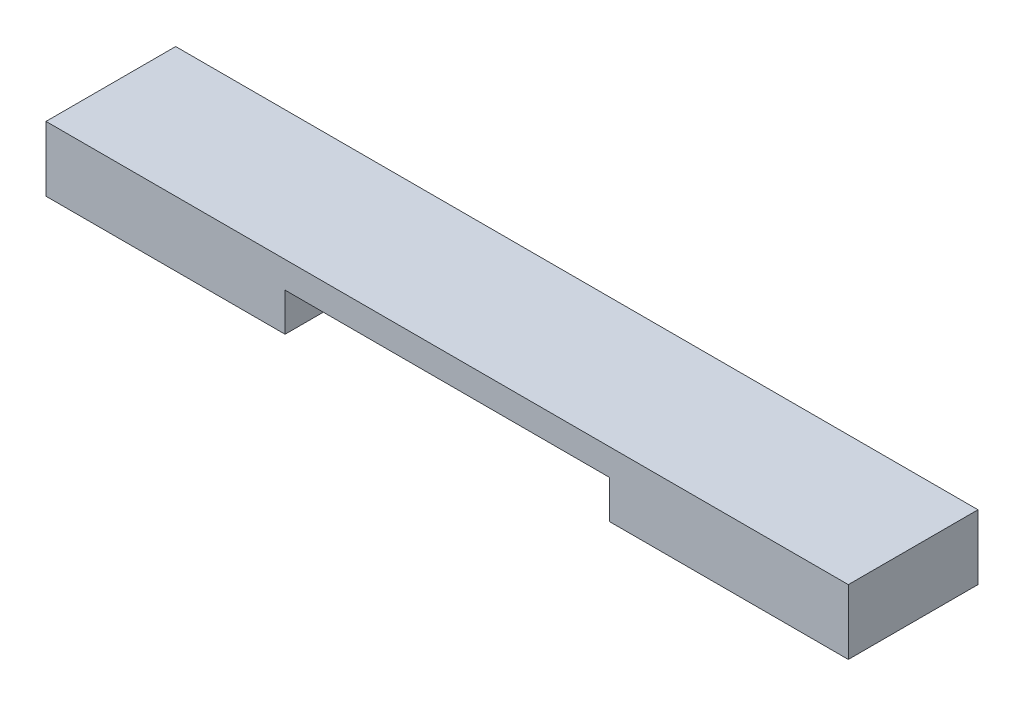
ISO-10303-21;
HEADER;
FILE_DESCRIPTION(('STEP AP214'),'2;1');
FILE_NAME('part.step','',(''),(''),'','','');
FILE_SCHEMA(('AUTOMOTIVE_DESIGN { 1 0 10303 214 1 1 1 1 }'));
ENDSEC;
DATA;
#1=APPLICATION_CONTEXT('core data for automotive mechanical design processes');
#2=APPLICATION_PROTOCOL_DEFINITION('international standard','automotive_design',2000,#1);
#3=PRODUCT_CONTEXT('',#1,'mechanical');
#4=PRODUCT('Part','Part','',(#3));
#5=PRODUCT_RELATED_PRODUCT_CATEGORY('part','',(#4));
#6=PRODUCT_DEFINITION_FORMATION('','',#4);
#7=PRODUCT_DEFINITION_CONTEXT('part definition',#1,'design');
#8=PRODUCT_DEFINITION('design','',#6,#7);
#9=PRODUCT_DEFINITION_SHAPE('','',#8);
#10=(LENGTH_UNIT() NAMED_UNIT(*) SI_UNIT(.MILLI.,.METRE.));
#11=(NAMED_UNIT(*) PLANE_ANGLE_UNIT() SI_UNIT($,.RADIAN.));
#12=(NAMED_UNIT(*) SI_UNIT($,.STERADIAN.) SOLID_ANGLE_UNIT());
#13=UNCERTAINTY_MEASURE_WITH_UNIT(LENGTH_MEASURE(1.E-05),#10,'distance_accuracy_value','');
#14=(GEOMETRIC_REPRESENTATION_CONTEXT(3) GLOBAL_UNCERTAINTY_ASSIGNED_CONTEXT((#13)) GLOBAL_UNIT_ASSIGNED_CONTEXT((#10,
#11,#12)) REPRESENTATION_CONTEXT('',''));
#15=CARTESIAN_POINT('',(0.,0.,0.));
#16=DIRECTION('',(0.,0.,1.));
#17=DIRECTION('',(1.,0.,0.));
#18=AXIS2_PLACEMENT_3D('',#15,#16,#17);
#19=CARTESIAN_POINT('',(24.75,-1.99999999999999,8.));
#20=DIRECTION('',(-1.,0.,0.));
#21=DIRECTION('',(0.,0.,1.));
#22=AXIS2_PLACEMENT_3D('',#19,#20,#21);
#23=PLANE('',#22);
#24=DIRECTION('',(0.,1.,0.));
#25=VECTOR('',#24,1.);
#26=CARTESIAN_POINT('',(24.75,-1.99999999999999,0.));
#27=LINE('',#26,#25);
#28=CARTESIAN_POINT('',(24.75,-1.99999999999999,0.));
#29=VERTEX_POINT('',#28);
#30=CARTESIAN_POINT('',(24.75,2.,0.));
#31=VERTEX_POINT('',#30);
#32=EDGE_CURVE('E129',#29,#31,#27,.T.);
#33=ORIENTED_EDGE('',*,*,#32,.T.);
#34=DIRECTION('',(0.,0.,-1.));
#35=VECTOR('',#34,1.);
#36=CARTESIAN_POINT('',(24.75,2.,8.));
#37=LINE('',#36,#35);
#38=CARTESIAN_POINT('',(24.75,2.,8.));
#39=VERTEX_POINT('',#38);
#40=EDGE_CURVE('E11',#39,#31,#37,.T.);
#41=ORIENTED_EDGE('',*,*,#40,.F.);
#42=DIRECTION('',(0.,1.,0.));
#43=VECTOR('',#42,1.);
#44=CARTESIAN_POINT('',(24.75,-1.99999999999999,8.));
#45=LINE('',#44,#43);
#46=CARTESIAN_POINT('',(24.75,-1.99999999999999,8.));
#47=VERTEX_POINT('',#46);
#48=EDGE_CURVE('E143',#47,#39,#45,.T.);
#49=ORIENTED_EDGE('',*,*,#48,.F.);
#50=DIRECTION('',(0.,0.,-1.));
#51=VECTOR('',#50,1.);
#52=CARTESIAN_POINT('',(24.75,-1.99999999999999,8.));
#53=LINE('',#52,#51);
#54=EDGE_CURVE('E125',#47,#29,#53,.T.);
#55=ORIENTED_EDGE('',*,*,#54,.T.);
#56=EDGE_LOOP('',(#33,#41,#49,#55));
#57=FACE_BOUND('',#56,.T.);
#58=ADVANCED_FACE('F33',(#57),#23,.F.);
#59=CARTESIAN_POINT('',(-24.75,2.,8.));
#60=DIRECTION('',(0.,-1.,0.));
#61=DIRECTION('',(0.,0.,-1.));
#62=AXIS2_PLACEMENT_3D('',#59,#60,#61);
#63=PLANE('',#62);
#64=DIRECTION('',(-1.,0.,0.));
#65=VECTOR('',#64,1.);
#66=CARTESIAN_POINT('',(-24.75,2.,0.));
#67=LINE('',#66,#65);
#68=CARTESIAN_POINT('',(-24.75,2.,0.));
#69=VERTEX_POINT('',#68);
#70=EDGE_CURVE('E132',#31,#69,#67,.T.);
#71=ORIENTED_EDGE('',*,*,#70,.T.);
#72=DIRECTION('',(0.,0.,-1.));
#73=VECTOR('',#72,1.);
#74=CARTESIAN_POINT('',(-24.75,2.,8.));
#75=LINE('',#74,#73);
#76=CARTESIAN_POINT('',(-24.75,2.,8.));
#77=VERTEX_POINT('',#76);
#78=EDGE_CURVE('E41',#77,#69,#75,.T.);
#79=ORIENTED_EDGE('',*,*,#78,.F.);
#80=DIRECTION('',(-1.,0.,0.));
#81=VECTOR('',#80,1.);
#82=CARTESIAN_POINT('',(-24.75,2.,8.));
#83=LINE('',#82,#81);
#84=EDGE_CURVE('E92',#39,#77,#83,.T.);
#85=ORIENTED_EDGE('',*,*,#84,.F.);
#86=ORIENTED_EDGE('',*,*,#40,.T.);
#87=EDGE_LOOP('',(#71,#79,#85,#86));
#88=FACE_BOUND('',#87,.T.);
#89=ADVANCED_FACE('F178',(#88),#63,.F.);
#90=CARTESIAN_POINT('',(-24.75,-2.,8.));
#91=DIRECTION('',(1.,0.,0.));
#92=DIRECTION('',(0.,0.,-1.));
#93=AXIS2_PLACEMENT_3D('',#90,#91,#92);
#94=PLANE('',#93);
#95=DIRECTION('',(0.,-1.,0.));
#96=VECTOR('',#95,1.);
#97=CARTESIAN_POINT('',(-24.75,-2.,0.));
#98=LINE('',#97,#96);
#99=CARTESIAN_POINT('',(-24.75,-2.,0.));
#100=VERTEX_POINT('',#99);
#101=EDGE_CURVE('E134',#69,#100,#98,.T.);
#102=ORIENTED_EDGE('',*,*,#101,.T.);
#103=DIRECTION('',(0.,0.,-1.));
#104=VECTOR('',#103,1.);
#105=CARTESIAN_POINT('',(-24.75,-2.,8.));
#106=LINE('',#105,#104);
#107=CARTESIAN_POINT('',(-24.75,-2.,8.));
#108=VERTEX_POINT('',#107);
#109=EDGE_CURVE('E150',#108,#100,#106,.T.);
#110=ORIENTED_EDGE('',*,*,#109,.F.);
#111=DIRECTION('',(0.,-1.,0.));
#112=VECTOR('',#111,1.);
#113=CARTESIAN_POINT('',(-24.75,-2.,8.));
#114=LINE('',#113,#112);
#115=EDGE_CURVE('E158',#77,#108,#114,.T.);
#116=ORIENTED_EDGE('',*,*,#115,.F.);
#117=ORIENTED_EDGE('',*,*,#78,.T.);
#118=EDGE_LOOP('',(#102,#110,#116,#117));
#119=FACE_BOUND('',#118,.T.);
#120=ADVANCED_FACE('F156',(#119),#94,.F.);
#121=CARTESIAN_POINT('',(-24.75,-2.,8.));
#122=DIRECTION('',(0.,1.,0.));
#123=DIRECTION('',(0.,0.,1.));
#124=AXIS2_PLACEMENT_3D('',#121,#122,#123);
#125=PLANE('',#124);
#126=DIRECTION('',(1.,0.,0.));
#127=VECTOR('',#126,1.);
#128=CARTESIAN_POINT('',(-24.75,-2.,0.));
#129=LINE('',#128,#127);
#130=CARTESIAN_POINT('',(-10.,-2.,0.));
#131=VERTEX_POINT('',#130);
#132=EDGE_CURVE('E136',#100,#131,#129,.T.);
#133=ORIENTED_EDGE('',*,*,#132,.T.);
#134=DIRECTION('',(0.,0.,-1.));
#135=VECTOR('',#134,1.);
#136=CARTESIAN_POINT('',(-10.,-2.,8.));
#137=LINE('',#136,#135);
#138=CARTESIAN_POINT('',(-10.,-2.,8.));
#139=VERTEX_POINT('',#138);
#140=EDGE_CURVE('E147',#139,#131,#137,.T.);
#141=ORIENTED_EDGE('',*,*,#140,.F.);
#142=DIRECTION('',(1.,0.,0.));
#143=VECTOR('',#142,1.);
#144=CARTESIAN_POINT('',(-24.75,-2.,8.));
#145=LINE('',#144,#143);
#146=EDGE_CURVE('E170',#108,#139,#145,.T.);
#147=ORIENTED_EDGE('',*,*,#146,.F.);
#148=ORIENTED_EDGE('',*,*,#109,.T.);
#149=EDGE_LOOP('',(#133,#141,#147,#148));
#150=FACE_BOUND('',#149,.T.);
#151=ADVANCED_FACE('F166',(#150),#125,.F.);
#152=CARTESIAN_POINT('',(-10.,-2.,8.));
#153=DIRECTION('',(-1.,0.,0.));
#154=DIRECTION('',(0.,0.,1.));
#155=AXIS2_PLACEMENT_3D('',#152,#153,#154);
#156=PLANE('',#155);
#157=DIRECTION('',(0.,1.,0.));
#158=VECTOR('',#157,1.);
#159=CARTESIAN_POINT('',(-10.,-2.,0.));
#160=LINE('',#159,#158);
#161=CARTESIAN_POINT('',(-10.,0.36,0.));
#162=VERTEX_POINT('',#161);
#163=EDGE_CURVE('E138',#131,#162,#160,.T.);
#164=ORIENTED_EDGE('',*,*,#163,.T.);
#165=DIRECTION('',(0.,0.,-1.));
#166=VECTOR('',#165,1.);
#167=CARTESIAN_POINT('',(-10.,0.36,8.));
#168=LINE('',#167,#166);
#169=CARTESIAN_POINT('',(-10.,0.36,8.));
#170=VERTEX_POINT('',#169);
#171=EDGE_CURVE('E120',#170,#162,#168,.T.);
#172=ORIENTED_EDGE('',*,*,#171,.F.);
#173=DIRECTION('',(0.,1.,0.));
#174=VECTOR('',#173,1.);
#175=CARTESIAN_POINT('',(-10.,-2.,8.));
#176=LINE('',#175,#174);
#177=EDGE_CURVE('E111',#139,#170,#176,.T.);
#178=ORIENTED_EDGE('',*,*,#177,.F.);
#179=ORIENTED_EDGE('',*,*,#140,.T.);
#180=EDGE_LOOP('',(#164,#172,#178,#179));
#181=FACE_BOUND('',#180,.T.);
#182=ADVANCED_FACE('F169',(#181),#156,.F.);
#183=CARTESIAN_POINT('',(-10.,0.36,8.));
#184=DIRECTION('',(0.,1.,0.));
#185=DIRECTION('',(-1.,0.,0.));
#186=AXIS2_PLACEMENT_3D('',#183,#184,#185);
#187=PLANE('',#186);
#188=DIRECTION('',(1.,0.,0.));
#189=VECTOR('',#188,1.);
#190=CARTESIAN_POINT('',(-10.,0.36,0.));
#191=LINE('',#190,#189);
#192=CARTESIAN_POINT('',(10.,0.36,0.));
#193=VERTEX_POINT('',#192);
#194=EDGE_CURVE('E119',#162,#193,#191,.T.);
#195=ORIENTED_EDGE('',*,*,#194,.T.);
#196=DIRECTION('',(0.,0.,-1.));
#197=VECTOR('',#196,1.);
#198=CARTESIAN_POINT('',(10.,0.36,8.));
#199=LINE('',#198,#197);
#200=CARTESIAN_POINT('',(10.,0.36,8.));
#201=VERTEX_POINT('',#200);
#202=EDGE_CURVE('E116',#201,#193,#199,.T.);
#203=ORIENTED_EDGE('',*,*,#202,.F.);
#204=DIRECTION('',(1.,0.,0.));
#205=VECTOR('',#204,1.);
#206=CARTESIAN_POINT('',(-10.,0.36,8.));
#207=LINE('',#206,#205);
#208=EDGE_CURVE('E105',#170,#201,#207,.T.);
#209=ORIENTED_EDGE('',*,*,#208,.F.);
#210=ORIENTED_EDGE('',*,*,#171,.T.);
#211=EDGE_LOOP('',(#195,#203,#209,#210));
#212=FACE_BOUND('',#211,.T.);
#213=ADVANCED_FACE('F117',(#212),#187,.F.);
#214=CARTESIAN_POINT('',(10.,-2.,8.));
#215=DIRECTION('',(1.,0.,0.));
#216=DIRECTION('',(0.,0.,-1.));
#217=AXIS2_PLACEMENT_3D('',#214,#215,#216);
#218=PLANE('',#217);
#219=DIRECTION('',(0.,-1.,0.));
#220=VECTOR('',#219,1.);
#221=CARTESIAN_POINT('',(10.,-2.,0.));
#222=LINE('',#221,#220);
#223=CARTESIAN_POINT('',(10.,-2.,0.));
#224=VERTEX_POINT('',#223);
#225=EDGE_CURVE('E78',#193,#224,#222,.T.);
#226=ORIENTED_EDGE('',*,*,#225,.T.);
#227=DIRECTION('',(0.,0.,-1.));
#228=VECTOR('',#227,1.);
#229=CARTESIAN_POINT('',(10.,-2.,8.));
#230=LINE('',#229,#228);
#231=CARTESIAN_POINT('',(10.,-2.,8.));
#232=VERTEX_POINT('',#231);
#233=EDGE_CURVE('E121',#232,#224,#230,.T.);
#234=ORIENTED_EDGE('',*,*,#233,.F.);
#235=DIRECTION('',(0.,-1.,0.));
#236=VECTOR('',#235,1.);
#237=CARTESIAN_POINT('',(10.,-2.,8.));
#238=LINE('',#237,#236);
#239=EDGE_CURVE('E109',#201,#232,#238,.T.);
#240=ORIENTED_EDGE('',*,*,#239,.F.);
#241=ORIENTED_EDGE('',*,*,#202,.T.);
#242=EDGE_LOOP('',(#226,#234,#240,#241));
#243=FACE_BOUND('',#242,.T.);
#244=ADVANCED_FACE('F123',(#243),#218,.F.);
#245=CARTESIAN_POINT('',(10.,-2.,8.));
#246=DIRECTION('',(0.,1.,0.));
#247=DIRECTION('',(-1.,0.,0.));
#248=AXIS2_PLACEMENT_3D('',#245,#246,#247);
#249=PLANE('',#248);
#250=DIRECTION('',(1.,0.,0.));
#251=VECTOR('',#250,1.);
#252=CARTESIAN_POINT('',(10.,-2.,0.));
#253=LINE('',#252,#251);
#254=EDGE_CURVE('E84',#224,#29,#253,.T.);
#255=ORIENTED_EDGE('',*,*,#254,.T.);
#256=ORIENTED_EDGE('',*,*,#54,.F.);
#257=DIRECTION('',(1.,0.,0.));
#258=VECTOR('',#257,1.);
#259=CARTESIAN_POINT('',(10.,-2.,8.));
#260=LINE('',#259,#258);
#261=EDGE_CURVE('E49',#232,#47,#260,.T.);
#262=ORIENTED_EDGE('',*,*,#261,.F.);
#263=ORIENTED_EDGE('',*,*,#233,.T.);
#264=EDGE_LOOP('',(#255,#256,#262,#263));
#265=FACE_BOUND('',#264,.T.);
#266=ADVANCED_FACE('F194',(#265),#249,.F.);
#267=CARTESIAN_POINT('',(0.,0.,8.));
#268=DIRECTION('',(0.,0.,-1.));
#269=DIRECTION('',(-1.,0.,0.));
#270=AXIS2_PLACEMENT_3D('',#267,#268,#269);
#271=PLANE('',#270);
#272=ORIENTED_EDGE('',*,*,#48,.T.);
#273=ORIENTED_EDGE('',*,*,#84,.T.);
#274=ORIENTED_EDGE('',*,*,#115,.T.);
#275=ORIENTED_EDGE('',*,*,#146,.T.);
#276=ORIENTED_EDGE('',*,*,#177,.T.);
#277=ORIENTED_EDGE('',*,*,#208,.T.);
#278=ORIENTED_EDGE('',*,*,#239,.T.);
#279=ORIENTED_EDGE('',*,*,#261,.T.);
#280=EDGE_LOOP('',(#272,#273,#274,#275,#276,#277,#278,#279));
#281=FACE_BOUND('',#280,.T.);
#282=ADVANCED_FACE('F107',(#281),#271,.F.);
#283=CARTESIAN_POINT('',(0.,0.,0.));
#284=DIRECTION('',(0.,0.,-1.));
#285=DIRECTION('',(-1.,0.,0.));
#286=AXIS2_PLACEMENT_3D('',#283,#284,#285);
#287=PLANE('',#286);
#288=ORIENTED_EDGE('',*,*,#32,.F.);
#289=ORIENTED_EDGE('',*,*,#254,.F.);
#290=ORIENTED_EDGE('',*,*,#225,.F.);
#291=ORIENTED_EDGE('',*,*,#194,.F.);
#292=ORIENTED_EDGE('',*,*,#163,.F.);
#293=ORIENTED_EDGE('',*,*,#132,.F.);
#294=ORIENTED_EDGE('',*,*,#101,.F.);
#295=ORIENTED_EDGE('',*,*,#70,.F.);
#296=EDGE_LOOP('',(#288,#289,#290,#291,#292,#293,#294,#295));
#297=FACE_BOUND('',#296,.T.);
#298=ADVANCED_FACE('F162',(#297),#287,.T.);
#299=CLOSED_SHELL('',(#58,#89,#120,#151,#182,#213,#244,#266,#282,#298));
#300=MANIFOLD_SOLID_BREP('B2',#299);
#301=ADVANCED_BREP_SHAPE_REPRESENTATION('',(#18,#300),#14);
#302=SHAPE_DEFINITION_REPRESENTATION(#9,#301);
ENDSEC;
END-ISO-10303-21;
